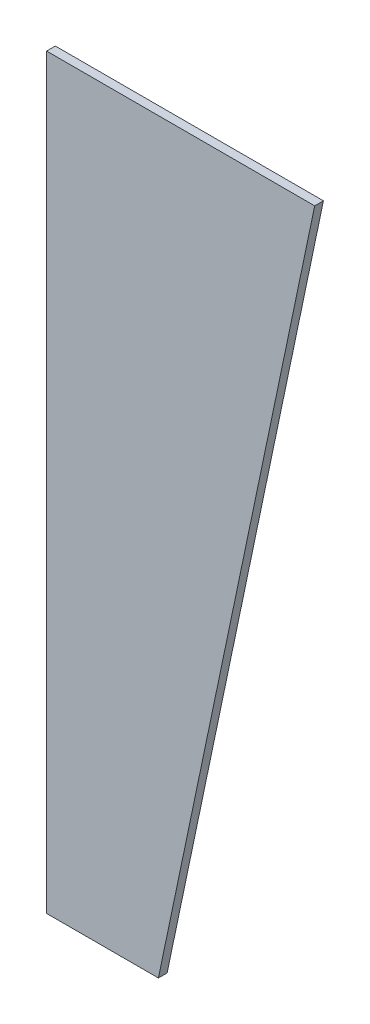
ISO-10303-21;
HEADER;
FILE_DESCRIPTION(('STEP AP214'),'2;1');
FILE_NAME('part.step','',(''),(''),'','','');
FILE_SCHEMA(('AUTOMOTIVE_DESIGN { 1 0 10303 214 1 1 1 1 }'));
ENDSEC;
DATA;
#1=APPLICATION_CONTEXT('core data for automotive mechanical design processes');
#2=APPLICATION_PROTOCOL_DEFINITION('international standard','automotive_design',2000,#1);
#3=PRODUCT_CONTEXT('',#1,'mechanical');
#4=PRODUCT('Part','Part','',(#3));
#5=PRODUCT_RELATED_PRODUCT_CATEGORY('part','',(#4));
#6=PRODUCT_DEFINITION_FORMATION('','',#4);
#7=PRODUCT_DEFINITION_CONTEXT('part definition',#1,'design');
#8=PRODUCT_DEFINITION('design','',#6,#7);
#9=PRODUCT_DEFINITION_SHAPE('','',#8);
#10=(LENGTH_UNIT() NAMED_UNIT(*) SI_UNIT(.MILLI.,.METRE.));
#11=(NAMED_UNIT(*) PLANE_ANGLE_UNIT() SI_UNIT($,.RADIAN.));
#12=(NAMED_UNIT(*) SI_UNIT($,.STERADIAN.) SOLID_ANGLE_UNIT());
#13=UNCERTAINTY_MEASURE_WITH_UNIT(LENGTH_MEASURE(1.E-05),#10,'distance_accuracy_value','');
#14=(GEOMETRIC_REPRESENTATION_CONTEXT(3) GLOBAL_UNCERTAINTY_ASSIGNED_CONTEXT((#13)) GLOBAL_UNIT_ASSIGNED_CONTEXT((#10,
#11,#12)) REPRESENTATION_CONTEXT('',''));
#15=CARTESIAN_POINT('',(0.,0.,0.));
#16=DIRECTION('',(0.,0.,1.));
#17=DIRECTION('',(1.,0.,0.));
#18=AXIS2_PLACEMENT_3D('',#15,#16,#17);
#19=CARTESIAN_POINT('',(0.,257.,3.));
#20=DIRECTION('',(0.,1.,0.));
#21=DIRECTION('',(0.,0.,1.));
#22=AXIS2_PLACEMENT_3D('',#19,#20,#21);
#23=PLANE('',#22);
#24=DIRECTION('',(1.,0.,0.));
#25=VECTOR('',#24,1.);
#26=CARTESIAN_POINT('',(0.,257.,0.));
#27=LINE('',#26,#25);
#28=CARTESIAN_POINT('',(0.,257.,0.));
#29=VERTEX_POINT('',#28);
#30=CARTESIAN_POINT('',(92.26,257.,0.));
#31=VERTEX_POINT('',#30);
#32=EDGE_CURVE('E98',#29,#31,#27,.T.);
#33=ORIENTED_EDGE('',*,*,#32,.F.);
#34=DIRECTION('',(0.,0.,-1.));
#35=VECTOR('',#34,1.);
#36=CARTESIAN_POINT('',(0.,257.,3.));
#37=LINE('',#36,#35);
#38=CARTESIAN_POINT('',(0.,257.,3.));
#39=VERTEX_POINT('',#38);
#40=EDGE_CURVE('E11',#39,#29,#37,.T.);
#41=ORIENTED_EDGE('',*,*,#40,.F.);
#42=DIRECTION('',(1.,0.,0.));
#43=VECTOR('',#42,1.);
#44=CARTESIAN_POINT('',(0.,257.,3.));
#45=LINE('',#44,#43);
#46=CARTESIAN_POINT('',(92.26,257.,3.));
#47=VERTEX_POINT('',#46);
#48=EDGE_CURVE('E92',#39,#47,#45,.T.);
#49=ORIENTED_EDGE('',*,*,#48,.T.);
#50=DIRECTION('',(0.,0.,-1.));
#51=VECTOR('',#50,1.);
#52=CARTESIAN_POINT('',(92.26,257.,3.));
#53=LINE('',#52,#51);
#54=EDGE_CURVE('E73',#47,#31,#53,.T.);
#55=ORIENTED_EDGE('',*,*,#54,.T.);
#56=EDGE_LOOP('',(#33,#41,#49,#55));
#57=FACE_BOUND('',#56,.T.);
#58=ADVANCED_FACE('F35',(#57),#23,.T.);
#59=CARTESIAN_POINT('',(0.,0.,3.));
#60=DIRECTION('',(-1.,0.,0.));
#61=DIRECTION('',(0.,0.,1.));
#62=AXIS2_PLACEMENT_3D('',#59,#60,#61);
#63=PLANE('',#62);
#64=DIRECTION('',(0.,1.,0.));
#65=VECTOR('',#64,1.);
#66=CARTESIAN_POINT('',(0.,0.,0.));
#67=LINE('',#66,#65);
#68=CARTESIAN_POINT('',(0.,0.,0.));
#69=VERTEX_POINT('',#68);
#70=EDGE_CURVE('E86',#69,#29,#67,.T.);
#71=ORIENTED_EDGE('',*,*,#70,.F.);
#72=DIRECTION('',(0.,0.,-1.));
#73=VECTOR('',#72,1.);
#74=CARTESIAN_POINT('',(0.,0.,3.));
#75=LINE('',#74,#73);
#76=CARTESIAN_POINT('',(0.,0.,3.));
#77=VERTEX_POINT('',#76);
#78=EDGE_CURVE('E43',#77,#69,#75,.T.);
#79=ORIENTED_EDGE('',*,*,#78,.F.);
#80=DIRECTION('',(0.,1.,0.));
#81=VECTOR('',#80,1.);
#82=CARTESIAN_POINT('',(0.,0.,3.));
#83=LINE('',#82,#81);
#84=EDGE_CURVE('E84',#77,#39,#83,.T.);
#85=ORIENTED_EDGE('',*,*,#84,.T.);
#86=ORIENTED_EDGE('',*,*,#40,.T.);
#87=EDGE_LOOP('',(#71,#79,#85,#86));
#88=FACE_BOUND('',#87,.T.);
#89=ADVANCED_FACE('F82',(#88),#63,.T.);
#90=CARTESIAN_POINT('',(0.,0.,3.));
#91=DIRECTION('',(0.,1.,0.));
#92=DIRECTION('',(0.,0.,1.));
#93=AXIS2_PLACEMENT_3D('',#90,#91,#92);
#94=PLANE('',#93);
#95=DIRECTION('',(1.,0.,0.));
#96=VECTOR('',#95,1.);
#97=CARTESIAN_POINT('',(0.,0.,0.));
#98=LINE('',#97,#96);
#99=CARTESIAN_POINT('',(38.48,0.,0.));
#100=VERTEX_POINT('',#99);
#101=EDGE_CURVE('E66',#69,#100,#98,.T.);
#102=ORIENTED_EDGE('',*,*,#101,.T.);
#103=DIRECTION('',(0.,0.,-1.));
#104=VECTOR('',#103,1.);
#105=CARTESIAN_POINT('',(38.48,0.,3.));
#106=LINE('',#105,#104);
#107=CARTESIAN_POINT('',(38.48,0.,3.));
#108=VERTEX_POINT('',#107);
#109=EDGE_CURVE('E87',#108,#100,#106,.T.);
#110=ORIENTED_EDGE('',*,*,#109,.F.);
#111=DIRECTION('',(1.,0.,0.));
#112=VECTOR('',#111,1.);
#113=CARTESIAN_POINT('',(0.,0.,3.));
#114=LINE('',#113,#112);
#115=EDGE_CURVE('E88',#77,#108,#114,.T.);
#116=ORIENTED_EDGE('',*,*,#115,.F.);
#117=ORIENTED_EDGE('',*,*,#78,.T.);
#118=EDGE_LOOP('',(#102,#110,#116,#117));
#119=FACE_BOUND('',#118,.T.);
#120=ADVANCED_FACE('F89',(#119),#94,.F.);
#121=CARTESIAN_POINT('',(36.865651614367,-7.71453207712318,3.));
#122=DIRECTION('',(-0.978798794122388,0.204824121198062,0.));
#123=DIRECTION('',(-0.204824121198062,-0.978798794122388,0.));
#124=AXIS2_PLACEMENT_3D('',#121,#122,#123);
#125=PLANE('',#124);
#126=DIRECTION('',(0.204824121198062,0.978798794122388,0.));
#127=VECTOR('',#126,1.);
#128=CARTESIAN_POINT('',(36.865651614367,-7.71453207712318,0.));
#129=LINE('',#128,#127);
#130=EDGE_CURVE('E94',#100,#31,#129,.T.);
#131=ORIENTED_EDGE('',*,*,#130,.T.);
#132=ORIENTED_EDGE('',*,*,#54,.F.);
#133=DIRECTION('',(0.204824121198062,0.978798794122388,0.));
#134=VECTOR('',#133,1.);
#135=CARTESIAN_POINT('',(36.865651614367,-7.71453207712318,3.));
#136=LINE('',#135,#134);
#137=EDGE_CURVE('E51',#108,#47,#136,.T.);
#138=ORIENTED_EDGE('',*,*,#137,.F.);
#139=ORIENTED_EDGE('',*,*,#109,.T.);
#140=EDGE_LOOP('',(#131,#132,#138,#139));
#141=FACE_BOUND('',#140,.T.);
#142=ADVANCED_FACE('F107',(#141),#125,.F.);
#143=CARTESIAN_POINT('',(0.,0.,3.));
#144=DIRECTION('',(0.,0.,1.));
#145=DIRECTION('',(1.,0.,0.));
#146=AXIS2_PLACEMENT_3D('',#143,#144,#145);
#147=PLANE('',#146);
#148=ORIENTED_EDGE('',*,*,#48,.F.);
#149=ORIENTED_EDGE('',*,*,#84,.F.);
#150=ORIENTED_EDGE('',*,*,#115,.T.);
#151=ORIENTED_EDGE('',*,*,#137,.T.);
#152=EDGE_LOOP('',(#148,#149,#150,#151));
#153=FACE_BOUND('',#152,.T.);
#154=ADVANCED_FACE('F91',(#153),#147,.T.);
#155=CARTESIAN_POINT('',(0.,0.,0.));
#156=DIRECTION('',(0.,0.,1.));
#157=DIRECTION('',(1.,0.,0.));
#158=AXIS2_PLACEMENT_3D('',#155,#156,#157);
#159=PLANE('',#158);
#160=ORIENTED_EDGE('',*,*,#32,.T.);
#161=ORIENTED_EDGE('',*,*,#130,.F.);
#162=ORIENTED_EDGE('',*,*,#101,.F.);
#163=ORIENTED_EDGE('',*,*,#70,.T.);
#164=EDGE_LOOP('',(#160,#161,#162,#163));
#165=FACE_BOUND('',#164,.T.);
#166=ADVANCED_FACE('F109',(#165),#159,.F.);
#167=CLOSED_SHELL('',(#58,#89,#120,#142,#154,#166));
#168=MANIFOLD_SOLID_BREP('B2',#167);
#169=ADVANCED_BREP_SHAPE_REPRESENTATION('',(#18,#168),#14);
#170=SHAPE_DEFINITION_REPRESENTATION(#9,#169);
ENDSEC;
END-ISO-10303-21;
